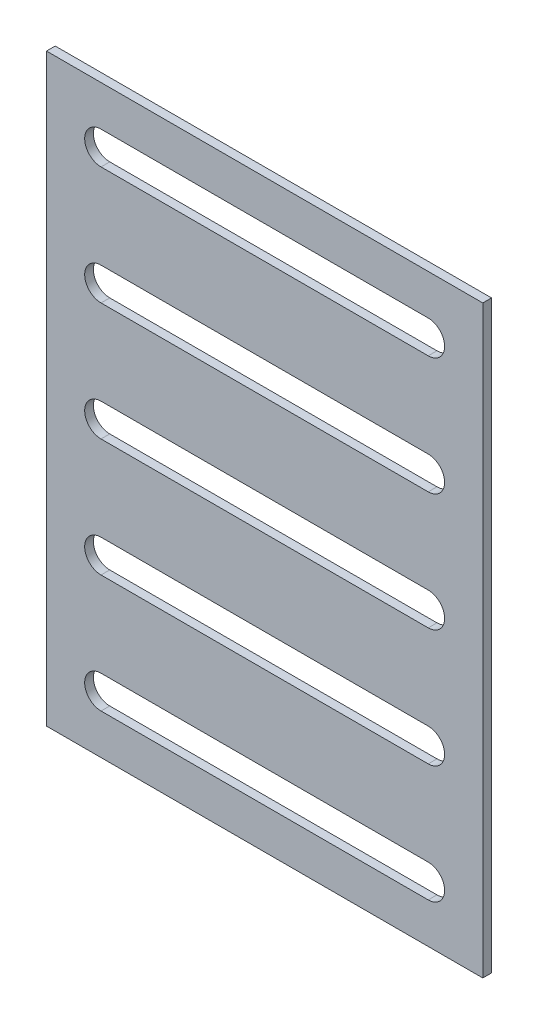
ISO-10303-21;
HEADER;
FILE_DESCRIPTION(('STEP AP214'),'2;1');
FILE_NAME('part.step','',(''),(''),'','','');
FILE_SCHEMA(('AUTOMOTIVE_DESIGN { 1 0 10303 214 1 1 1 1 }'));
ENDSEC;
DATA;
#1=APPLICATION_CONTEXT('core data for automotive mechanical design processes');
#2=APPLICATION_PROTOCOL_DEFINITION('international standard','automotive_design',2000,#1);
#3=PRODUCT_CONTEXT('',#1,'mechanical');
#4=PRODUCT('Part','Part','',(#3));
#5=PRODUCT_RELATED_PRODUCT_CATEGORY('part','',(#4));
#6=PRODUCT_DEFINITION_FORMATION('','',#4);
#7=PRODUCT_DEFINITION_CONTEXT('part definition',#1,'design');
#8=PRODUCT_DEFINITION('design','',#6,#7);
#9=PRODUCT_DEFINITION_SHAPE('','',#8);
#10=(LENGTH_UNIT() NAMED_UNIT(*) SI_UNIT(.MILLI.,.METRE.));
#11=(NAMED_UNIT(*) PLANE_ANGLE_UNIT() SI_UNIT($,.RADIAN.));
#12=(NAMED_UNIT(*) SI_UNIT($,.STERADIAN.) SOLID_ANGLE_UNIT());
#13=UNCERTAINTY_MEASURE_WITH_UNIT(LENGTH_MEASURE(1.E-05),#10,'distance_accuracy_value','');
#14=(GEOMETRIC_REPRESENTATION_CONTEXT(3) GLOBAL_UNCERTAINTY_ASSIGNED_CONTEXT((#13)) GLOBAL_UNIT_ASSIGNED_CONTEXT((#10,
#11,#12)) REPRESENTATION_CONTEXT('',''));
#15=CARTESIAN_POINT('',(0.,0.,0.));
#16=DIRECTION('',(0.,0.,1.));
#17=DIRECTION('',(1.,0.,0.));
#18=AXIS2_PLACEMENT_3D('',#15,#16,#17);
#19=CARTESIAN_POINT('',(-100.,134.,4.));
#20=DIRECTION('',(1.,0.,0.));
#21=DIRECTION('',(0.,1.,0.));
#22=AXIS2_PLACEMENT_3D('',#19,#20,#21);
#23=PLANE('',#22);
#24=DIRECTION('',(0.,-1.,0.));
#25=VECTOR('',#24,1.);
#26=CARTESIAN_POINT('',(-100.,134.,0.));
#27=LINE('',#26,#25);
#28=CARTESIAN_POINT('',(-100.,134.,0.));
#29=VERTEX_POINT('',#28);
#30=CARTESIAN_POINT('',(-100.,-134.,0.));
#31=VERTEX_POINT('',#30);
#32=EDGE_CURVE('E233',#29,#31,#27,.T.);
#33=ORIENTED_EDGE('',*,*,#32,.T.);
#34=DIRECTION('',(0.,0.,-1.));
#35=VECTOR('',#34,1.);
#36=CARTESIAN_POINT('',(-100.,-134.,4.));
#37=LINE('',#36,#35);
#38=CARTESIAN_POINT('',(-100.,-134.,4.));
#39=VERTEX_POINT('',#38);
#40=EDGE_CURVE('E11',#39,#31,#37,.T.);
#41=ORIENTED_EDGE('',*,*,#40,.F.);
#42=DIRECTION('',(0.,-1.,0.));
#43=VECTOR('',#42,1.);
#44=CARTESIAN_POINT('',(-100.,134.,4.));
#45=LINE('',#44,#43);
#46=CARTESIAN_POINT('',(-100.,134.,4.));
#47=VERTEX_POINT('',#46);
#48=EDGE_CURVE('E362',#47,#39,#45,.T.);
#49=ORIENTED_EDGE('',*,*,#48,.F.);
#50=DIRECTION('',(0.,0.,-1.));
#51=VECTOR('',#50,1.);
#52=CARTESIAN_POINT('',(-100.,134.,4.));
#53=LINE('',#52,#51);
#54=EDGE_CURVE('E372',#47,#29,#53,.T.);
#55=ORIENTED_EDGE('',*,*,#54,.T.);
#56=EDGE_LOOP('',(#33,#41,#49,#55));
#57=FACE_BOUND('',#56,.T.);
#58=ADVANCED_FACE('F36',(#57),#23,.F.);
#59=CARTESIAN_POINT('',(-100.,-134.,4.));
#60=DIRECTION('',(0.,1.,0.));
#61=DIRECTION('',(0.,0.,1.));
#62=AXIS2_PLACEMENT_3D('',#59,#60,#61);
#63=PLANE('',#62);
#64=DIRECTION('',(1.,0.,0.));
#65=VECTOR('',#64,1.);
#66=CARTESIAN_POINT('',(-100.,-134.,0.));
#67=LINE('',#66,#65);
#68=CARTESIAN_POINT('',(100.,-134.,0.));
#69=VERTEX_POINT('',#68);
#70=EDGE_CURVE('E375',#31,#69,#67,.T.);
#71=ORIENTED_EDGE('',*,*,#70,.T.);
#72=DIRECTION('',(0.,0.,-1.));
#73=VECTOR('',#72,1.);
#74=CARTESIAN_POINT('',(100.,-134.,4.));
#75=LINE('',#74,#73);
#76=CARTESIAN_POINT('',(100.,-134.,4.));
#77=VERTEX_POINT('',#76);
#78=EDGE_CURVE('E43',#77,#69,#75,.T.);
#79=ORIENTED_EDGE('',*,*,#78,.F.);
#80=DIRECTION('',(1.,0.,0.));
#81=VECTOR('',#80,1.);
#82=CARTESIAN_POINT('',(-100.,-134.,4.));
#83=LINE('',#82,#81);
#84=EDGE_CURVE('E365',#39,#77,#83,.T.);
#85=ORIENTED_EDGE('',*,*,#84,.F.);
#86=ORIENTED_EDGE('',*,*,#40,.T.);
#87=EDGE_LOOP('',(#71,#79,#85,#86));
#88=FACE_BOUND('',#87,.T.);
#89=ADVANCED_FACE('F404',(#88),#63,.F.);
#90=CARTESIAN_POINT('',(100.,134.,4.));
#91=DIRECTION('',(-1.,0.,0.));
#92=DIRECTION('',(0.,-1.,0.));
#93=AXIS2_PLACEMENT_3D('',#90,#91,#92);
#94=PLANE('',#93);
#95=DIRECTION('',(0.,1.,0.));
#96=VECTOR('',#95,1.);
#97=CARTESIAN_POINT('',(100.,134.,0.));
#98=LINE('',#97,#96);
#99=CARTESIAN_POINT('',(100.,134.,0.));
#100=VERTEX_POINT('',#99);
#101=EDGE_CURVE('E377',#69,#100,#98,.T.);
#102=ORIENTED_EDGE('',*,*,#101,.T.);
#103=DIRECTION('',(0.,0.,-1.));
#104=VECTOR('',#103,1.);
#105=CARTESIAN_POINT('',(100.,134.,4.));
#106=LINE('',#105,#104);
#107=CARTESIAN_POINT('',(100.,134.,4.));
#108=VERTEX_POINT('',#107);
#109=EDGE_CURVE('E382',#108,#100,#106,.T.);
#110=ORIENTED_EDGE('',*,*,#109,.F.);
#111=DIRECTION('',(0.,1.,0.));
#112=VECTOR('',#111,1.);
#113=CARTESIAN_POINT('',(100.,134.,4.));
#114=LINE('',#113,#112);
#115=EDGE_CURVE('E368',#77,#108,#114,.T.);
#116=ORIENTED_EDGE('',*,*,#115,.F.);
#117=ORIENTED_EDGE('',*,*,#78,.T.);
#118=EDGE_LOOP('',(#102,#110,#116,#117));
#119=FACE_BOUND('',#118,.T.);
#120=ADVANCED_FACE('F389',(#119),#94,.F.);
#121=CARTESIAN_POINT('',(-100.,134.,4.));
#122=DIRECTION('',(0.,-1.,0.));
#123=DIRECTION('',(0.,0.,-1.));
#124=AXIS2_PLACEMENT_3D('',#121,#122,#123);
#125=PLANE('',#124);
#126=DIRECTION('',(-1.,0.,0.));
#127=VECTOR('',#126,1.);
#128=CARTESIAN_POINT('',(-100.,134.,0.));
#129=LINE('',#128,#127);
#130=EDGE_CURVE('E366',#100,#29,#129,.T.);
#131=ORIENTED_EDGE('',*,*,#130,.T.);
#132=ORIENTED_EDGE('',*,*,#54,.F.);
#133=DIRECTION('',(-1.,0.,0.));
#134=VECTOR('',#133,1.);
#135=CARTESIAN_POINT('',(-100.,134.,4.));
#136=LINE('',#135,#134);
#137=EDGE_CURVE('E370',#108,#47,#136,.T.);
#138=ORIENTED_EDGE('',*,*,#137,.F.);
#139=ORIENTED_EDGE('',*,*,#109,.T.);
#140=EDGE_LOOP('',(#131,#132,#138,#139));
#141=FACE_BOUND('',#140,.T.);
#142=ADVANCED_FACE('F397',(#141),#125,.F.);
#143=CARTESIAN_POINT('',(0.,0.,4.));
#144=DIRECTION('',(0.,0.,1.));
#145=DIRECTION('',(1.,0.,0.));
#146=AXIS2_PLACEMENT_3D('',#143,#144,#145);
#147=PLANE('',#146);
#148=CARTESIAN_POINT('',(-75.,108.,4.));
#149=DIRECTION('',(0.,0.,1.));
#150=DIRECTION('',(1.,0.,0.));
#151=AXIS2_PLACEMENT_3D('',#148,#149,#150);
#152=CIRCLE('',#151,7.50000000000002);
#153=CARTESIAN_POINT('',(-75.,115.5,4.));
#154=VERTEX_POINT('',#153);
#155=CARTESIAN_POINT('',(-75.,100.5,4.));
#156=VERTEX_POINT('',#155);
#157=EDGE_CURVE('E50',#154,#156,#152,.T.);
#158=ORIENTED_EDGE('',*,*,#157,.F.);
#159=DIRECTION('',(-1.,0.,0.));
#160=VECTOR('',#159,1.);
#161=CARTESIAN_POINT('',(-75.,115.5,4.));
#162=LINE('',#161,#160);
#163=CARTESIAN_POINT('',(75.,115.5,4.));
#164=VERTEX_POINT('',#163);
#165=EDGE_CURVE('E217',#164,#154,#162,.T.);
#166=ORIENTED_EDGE('',*,*,#165,.F.);
#167=CARTESIAN_POINT('',(75.,108.,4.));
#168=DIRECTION('',(0.,0.,1.));
#169=DIRECTION('',(1.,0.,0.));
#170=AXIS2_PLACEMENT_3D('',#167,#168,#169);
#171=CIRCLE('',#170,7.50000000000002);
#172=CARTESIAN_POINT('',(75.,100.5,4.));
#173=VERTEX_POINT('',#172);
#174=EDGE_CURVE('E220',#173,#164,#171,.T.);
#175=ORIENTED_EDGE('',*,*,#174,.F.);
#176=DIRECTION('',(1.,0.,0.));
#177=VECTOR('',#176,1.);
#178=CARTESIAN_POINT('',(-75.,100.5,4.));
#179=LINE('',#178,#177);
#180=EDGE_CURVE('E226',#156,#173,#179,.T.);
#181=ORIENTED_EDGE('',*,*,#180,.F.);
#182=EDGE_LOOP('',(#158,#166,#175,#181));
#183=FACE_BOUND('',#182,.T.);
#184=CARTESIAN_POINT('',(-75.,54.,4.));
#185=DIRECTION('',(0.,0.,1.));
#186=DIRECTION('',(1.,0.,0.));
#187=AXIS2_PLACEMENT_3D('',#184,#185,#186);
#188=CIRCLE('',#187,7.50000000000002);
#189=CARTESIAN_POINT('',(-75.,61.5,4.));
#190=VERTEX_POINT('',#189);
#191=CARTESIAN_POINT('',(-75.,46.5,4.));
#192=VERTEX_POINT('',#191);
#193=EDGE_CURVE('E58',#190,#192,#188,.T.);
#194=ORIENTED_EDGE('',*,*,#193,.F.);
#195=DIRECTION('',(-1.,0.,0.));
#196=VECTOR('',#195,1.);
#197=CARTESIAN_POINT('',(-75.,61.5,4.));
#198=LINE('',#197,#196);
#199=CARTESIAN_POINT('',(75.,61.5,4.));
#200=VERTEX_POINT('',#199);
#201=EDGE_CURVE('E241',#200,#190,#198,.T.);
#202=ORIENTED_EDGE('',*,*,#201,.F.);
#203=CARTESIAN_POINT('',(75.,54.,4.));
#204=DIRECTION('',(0.,0.,1.));
#205=DIRECTION('',(1.,0.,0.));
#206=AXIS2_PLACEMENT_3D('',#203,#204,#205);
#207=CIRCLE('',#206,7.5);
#208=CARTESIAN_POINT('',(75.0000000000001,46.5,4.));
#209=VERTEX_POINT('',#208);
#210=EDGE_CURVE('E256',#209,#200,#207,.T.);
#211=ORIENTED_EDGE('',*,*,#210,.F.);
#212=DIRECTION('',(1.,0.,0.));
#213=VECTOR('',#212,1.);
#214=CARTESIAN_POINT('',(75.0000000000001,46.5,4.));
#215=LINE('',#214,#213);
#216=EDGE_CURVE('E252',#192,#209,#215,.T.);
#217=ORIENTED_EDGE('',*,*,#216,.F.);
#218=EDGE_LOOP('',(#194,#202,#211,#217));
#219=FACE_BOUND('',#218,.T.);
#220=CARTESIAN_POINT('',(-75.,0.,4.));
#221=DIRECTION('',(0.,0.,1.));
#222=DIRECTION('',(1.,0.,0.));
#223=AXIS2_PLACEMENT_3D('',#220,#221,#222);
#224=CIRCLE('',#223,7.50000000000001);
#225=CARTESIAN_POINT('',(-75.,7.50000000000001,4.));
#226=VERTEX_POINT('',#225);
#227=CARTESIAN_POINT('',(-75.,-7.50000000000001,4.));
#228=VERTEX_POINT('',#227);
#229=EDGE_CURVE('E281',#226,#228,#224,.T.);
#230=ORIENTED_EDGE('',*,*,#229,.F.);
#231=DIRECTION('',(-1.,0.,0.));
#232=VECTOR('',#231,1.);
#233=CARTESIAN_POINT('',(-75.,7.50000000000001,4.));
#234=LINE('',#233,#232);
#235=CARTESIAN_POINT('',(75.,7.50000000000001,4.));
#236=VERTEX_POINT('',#235);
#237=EDGE_CURVE('E271',#236,#226,#234,.T.);
#238=ORIENTED_EDGE('',*,*,#237,.F.);
#239=CARTESIAN_POINT('',(75.,0.,4.));
#240=DIRECTION('',(0.,0.,1.));
#241=DIRECTION('',(1.,0.,0.));
#242=AXIS2_PLACEMENT_3D('',#239,#240,#241);
#243=CIRCLE('',#242,7.50000000000001);
#244=CARTESIAN_POINT('',(75.,-7.50000000000001,4.));
#245=VERTEX_POINT('',#244);
#246=EDGE_CURVE('E287',#245,#236,#243,.T.);
#247=ORIENTED_EDGE('',*,*,#246,.F.);
#248=DIRECTION('',(1.,0.,0.));
#249=VECTOR('',#248,1.);
#250=CARTESIAN_POINT('',(-75.,-7.50000000000001,4.));
#251=LINE('',#250,#249);
#252=EDGE_CURVE('E283',#228,#245,#251,.T.);
#253=ORIENTED_EDGE('',*,*,#252,.F.);
#254=EDGE_LOOP('',(#230,#238,#247,#253));
#255=FACE_BOUND('',#254,.T.);
#256=CARTESIAN_POINT('',(-75.,-54.,4.));
#257=DIRECTION('',(0.,0.,1.));
#258=DIRECTION('',(1.,0.,0.));
#259=AXIS2_PLACEMENT_3D('',#256,#257,#258);
#260=CIRCLE('',#259,7.50000000000001);
#261=CARTESIAN_POINT('',(-75.,-46.5,4.));
#262=VERTEX_POINT('',#261);
#263=CARTESIAN_POINT('',(-75.,-61.5,4.));
#264=VERTEX_POINT('',#263);
#265=EDGE_CURVE('E313',#262,#264,#260,.T.);
#266=ORIENTED_EDGE('',*,*,#265,.F.);
#267=DIRECTION('',(-1.,0.,0.));
#268=VECTOR('',#267,1.);
#269=CARTESIAN_POINT('',(-75.,-46.5,4.));
#270=LINE('',#269,#268);
#271=CARTESIAN_POINT('',(75.,-46.5,4.));
#272=VERTEX_POINT('',#271);
#273=EDGE_CURVE('E303',#272,#262,#270,.T.);
#274=ORIENTED_EDGE('',*,*,#273,.F.);
#275=CARTESIAN_POINT('',(75.,-54.,4.));
#276=DIRECTION('',(0.,0.,1.));
#277=DIRECTION('',(1.,0.,0.));
#278=AXIS2_PLACEMENT_3D('',#275,#276,#277);
#279=CIRCLE('',#278,7.50000000000001);
#280=CARTESIAN_POINT('',(75.,-61.5,4.));
#281=VERTEX_POINT('',#280);
#282=EDGE_CURVE('E319',#281,#272,#279,.T.);
#283=ORIENTED_EDGE('',*,*,#282,.F.);
#284=DIRECTION('',(1.,0.,0.));
#285=VECTOR('',#284,1.);
#286=CARTESIAN_POINT('',(-75.,-61.5,4.));
#287=LINE('',#286,#285);
#288=EDGE_CURVE('E315',#264,#281,#287,.T.);
#289=ORIENTED_EDGE('',*,*,#288,.F.);
#290=EDGE_LOOP('',(#266,#274,#283,#289));
#291=FACE_BOUND('',#290,.T.);
#292=CARTESIAN_POINT('',(-75.,-108.,4.));
#293=DIRECTION('',(0.,0.,1.));
#294=DIRECTION('',(1.,0.,0.));
#295=AXIS2_PLACEMENT_3D('',#292,#293,#294);
#296=CIRCLE('',#295,7.50000000000002);
#297=CARTESIAN_POINT('',(-75.,-100.5,4.));
#298=VERTEX_POINT('',#297);
#299=CARTESIAN_POINT('',(-75.,-115.5,4.));
#300=VERTEX_POINT('',#299);
#301=EDGE_CURVE('E345',#298,#300,#296,.T.);
#302=ORIENTED_EDGE('',*,*,#301,.F.);
#303=DIRECTION('',(-1.,0.,0.));
#304=VECTOR('',#303,1.);
#305=CARTESIAN_POINT('',(-75.,-100.5,4.));
#306=LINE('',#305,#304);
#307=CARTESIAN_POINT('',(75.,-100.5,4.));
#308=VERTEX_POINT('',#307);
#309=EDGE_CURVE('E335',#308,#298,#306,.T.);
#310=ORIENTED_EDGE('',*,*,#309,.F.);
#311=CARTESIAN_POINT('',(75.,-108.,4.));
#312=DIRECTION('',(0.,0.,1.));
#313=DIRECTION('',(1.,0.,0.));
#314=AXIS2_PLACEMENT_3D('',#311,#312,#313);
#315=CIRCLE('',#314,7.50000000000002);
#316=CARTESIAN_POINT('',(75.,-115.5,4.));
#317=VERTEX_POINT('',#316);
#318=EDGE_CURVE('E350',#317,#308,#315,.T.);
#319=ORIENTED_EDGE('',*,*,#318,.F.);
#320=DIRECTION('',(1.,0.,0.));
#321=VECTOR('',#320,1.);
#322=CARTESIAN_POINT('',(-75.,-115.5,4.));
#323=LINE('',#322,#321);
#324=EDGE_CURVE('E347',#300,#317,#323,.T.);
#325=ORIENTED_EDGE('',*,*,#324,.F.);
#326=EDGE_LOOP('',(#302,#310,#319,#325));
#327=FACE_BOUND('',#326,.T.);
#328=ORIENTED_EDGE('',*,*,#48,.T.);
#329=ORIENTED_EDGE('',*,*,#84,.T.);
#330=ORIENTED_EDGE('',*,*,#115,.T.);
#331=ORIENTED_EDGE('',*,*,#137,.T.);
#332=EDGE_LOOP('',(#328,#329,#330,#331));
#333=FACE_BOUND('',#332,.T.);
#334=ADVANCED_FACE('F403',(#183,#219,#255,#291,#327,#333),#147,.T.);
#335=CARTESIAN_POINT('',(0.,0.,0.));
#336=DIRECTION('',(0.,0.,1.));
#337=DIRECTION('',(1.,0.,0.));
#338=AXIS2_PLACEMENT_3D('',#335,#336,#337);
#339=PLANE('',#338);
#340=DIRECTION('',(-1.,0.,0.));
#341=VECTOR('',#340,1.);
#342=CARTESIAN_POINT('',(-75.,115.5,0.));
#343=LINE('',#342,#341);
#344=CARTESIAN_POINT('',(75.,115.5,0.));
#345=VERTEX_POINT('',#344);
#346=CARTESIAN_POINT('',(-75.,115.5,0.));
#347=VERTEX_POINT('',#346);
#348=EDGE_CURVE('E204',#345,#347,#343,.T.);
#349=ORIENTED_EDGE('',*,*,#348,.T.);
#350=CARTESIAN_POINT('',(-75.,108.,0.));
#351=DIRECTION('',(0.,0.,1.));
#352=DIRECTION('',(1.,0.,0.));
#353=AXIS2_PLACEMENT_3D('',#350,#351,#352);
#354=CIRCLE('',#353,7.50000000000002);
#355=CARTESIAN_POINT('',(-75.,100.5,0.));
#356=VERTEX_POINT('',#355);
#357=EDGE_CURVE('E198',#347,#356,#354,.T.);
#358=ORIENTED_EDGE('',*,*,#357,.T.);
#359=DIRECTION('',(1.,0.,0.));
#360=VECTOR('',#359,1.);
#361=CARTESIAN_POINT('',(-75.,100.5,0.));
#362=LINE('',#361,#360);
#363=CARTESIAN_POINT('',(75.,100.5,0.));
#364=VERTEX_POINT('',#363);
#365=EDGE_CURVE('E208',#356,#364,#362,.T.);
#366=ORIENTED_EDGE('',*,*,#365,.T.);
#367=CARTESIAN_POINT('',(75.,108.,0.));
#368=DIRECTION('',(0.,0.,1.));
#369=DIRECTION('',(1.,0.,0.));
#370=AXIS2_PLACEMENT_3D('',#367,#368,#369);
#371=CIRCLE('',#370,7.50000000000002);
#372=EDGE_CURVE('E212',#364,#345,#371,.T.);
#373=ORIENTED_EDGE('',*,*,#372,.T.);
#374=EDGE_LOOP('',(#349,#358,#366,#373));
#375=FACE_BOUND('',#374,.T.);
#376=DIRECTION('',(-1.,0.,0.));
#377=VECTOR('',#376,1.);
#378=CARTESIAN_POINT('',(-75.,61.5,0.));
#379=LINE('',#378,#377);
#380=CARTESIAN_POINT('',(75.,61.5,0.));
#381=VERTEX_POINT('',#380);
#382=CARTESIAN_POINT('',(-75.,61.5,0.));
#383=VERTEX_POINT('',#382);
#384=EDGE_CURVE('E247',#381,#383,#379,.T.);
#385=ORIENTED_EDGE('',*,*,#384,.T.);
#386=CARTESIAN_POINT('',(-75.,54.,0.));
#387=DIRECTION('',(0.,0.,1.));
#388=DIRECTION('',(1.,0.,0.));
#389=AXIS2_PLACEMENT_3D('',#386,#387,#388);
#390=CIRCLE('',#389,7.50000000000002);
#391=CARTESIAN_POINT('',(-75.,46.5,0.));
#392=VERTEX_POINT('',#391);
#393=EDGE_CURVE('E237',#383,#392,#390,.T.);
#394=ORIENTED_EDGE('',*,*,#393,.T.);
#395=DIRECTION('',(1.,0.,0.));
#396=VECTOR('',#395,1.);
#397=CARTESIAN_POINT('',(75.0000000000001,46.5,0.));
#398=LINE('',#397,#396);
#399=CARTESIAN_POINT('',(75.0000000000001,46.5,0.));
#400=VERTEX_POINT('',#399);
#401=EDGE_CURVE('E240',#392,#400,#398,.T.);
#402=ORIENTED_EDGE('',*,*,#401,.T.);
#403=CARTESIAN_POINT('',(75.,54.,0.));
#404=DIRECTION('',(0.,0.,1.));
#405=DIRECTION('',(1.,0.,0.));
#406=AXIS2_PLACEMENT_3D('',#403,#404,#405);
#407=CIRCLE('',#406,7.5);
#408=EDGE_CURVE('E244',#400,#381,#407,.T.);
#409=ORIENTED_EDGE('',*,*,#408,.T.);
#410=EDGE_LOOP('',(#385,#394,#402,#409));
#411=FACE_BOUND('',#410,.T.);
#412=DIRECTION('',(-1.,0.,0.));
#413=VECTOR('',#412,1.);
#414=CARTESIAN_POINT('',(-75.,7.50000000000001,0.));
#415=LINE('',#414,#413);
#416=CARTESIAN_POINT('',(75.,7.50000000000001,0.));
#417=VERTEX_POINT('',#416);
#418=CARTESIAN_POINT('',(-75.,7.50000000000001,0.));
#419=VERTEX_POINT('',#418);
#420=EDGE_CURVE('E277',#417,#419,#415,.T.);
#421=ORIENTED_EDGE('',*,*,#420,.T.);
#422=CARTESIAN_POINT('',(-75.,0.,0.));
#423=DIRECTION('',(0.,0.,1.));
#424=DIRECTION('',(1.,0.,0.));
#425=AXIS2_PLACEMENT_3D('',#422,#423,#424);
#426=CIRCLE('',#425,7.50000000000001);
#427=CARTESIAN_POINT('',(-75.,-7.50000000000001,0.));
#428=VERTEX_POINT('',#427);
#429=EDGE_CURVE('E267',#419,#428,#426,.T.);
#430=ORIENTED_EDGE('',*,*,#429,.T.);
#431=DIRECTION('',(1.,0.,0.));
#432=VECTOR('',#431,1.);
#433=CARTESIAN_POINT('',(-75.,-7.50000000000001,0.));
#434=LINE('',#433,#432);
#435=CARTESIAN_POINT('',(75.,-7.50000000000001,0.));
#436=VERTEX_POINT('',#435);
#437=EDGE_CURVE('E270',#428,#436,#434,.T.);
#438=ORIENTED_EDGE('',*,*,#437,.T.);
#439=CARTESIAN_POINT('',(75.,0.,0.));
#440=DIRECTION('',(0.,0.,1.));
#441=DIRECTION('',(1.,0.,0.));
#442=AXIS2_PLACEMENT_3D('',#439,#440,#441);
#443=CIRCLE('',#442,7.50000000000001);
#444=EDGE_CURVE('E274',#436,#417,#443,.T.);
#445=ORIENTED_EDGE('',*,*,#444,.T.);
#446=EDGE_LOOP('',(#421,#430,#438,#445));
#447=FACE_BOUND('',#446,.T.);
#448=DIRECTION('',(-1.,0.,0.));
#449=VECTOR('',#448,1.);
#450=CARTESIAN_POINT('',(-75.,-46.5,0.));
#451=LINE('',#450,#449);
#452=CARTESIAN_POINT('',(75.,-46.5,0.));
#453=VERTEX_POINT('',#452);
#454=CARTESIAN_POINT('',(-75.,-46.5,0.));
#455=VERTEX_POINT('',#454);
#456=EDGE_CURVE('E309',#453,#455,#451,.T.);
#457=ORIENTED_EDGE('',*,*,#456,.T.);
#458=CARTESIAN_POINT('',(-75.,-54.,0.));
#459=DIRECTION('',(0.,0.,1.));
#460=DIRECTION('',(1.,0.,0.));
#461=AXIS2_PLACEMENT_3D('',#458,#459,#460);
#462=CIRCLE('',#461,7.50000000000001);
#463=CARTESIAN_POINT('',(-75.,-61.5,0.));
#464=VERTEX_POINT('',#463);
#465=EDGE_CURVE('E299',#455,#464,#462,.T.);
#466=ORIENTED_EDGE('',*,*,#465,.T.);
#467=DIRECTION('',(1.,0.,0.));
#468=VECTOR('',#467,1.);
#469=CARTESIAN_POINT('',(-75.,-61.5,0.));
#470=LINE('',#469,#468);
#471=CARTESIAN_POINT('',(75.,-61.5,0.));
#472=VERTEX_POINT('',#471);
#473=EDGE_CURVE('E302',#464,#472,#470,.T.);
#474=ORIENTED_EDGE('',*,*,#473,.T.);
#475=CARTESIAN_POINT('',(75.,-54.,0.));
#476=DIRECTION('',(0.,0.,1.));
#477=DIRECTION('',(1.,0.,0.));
#478=AXIS2_PLACEMENT_3D('',#475,#476,#477);
#479=CIRCLE('',#478,7.50000000000001);
#480=EDGE_CURVE('E306',#472,#453,#479,.T.);
#481=ORIENTED_EDGE('',*,*,#480,.T.);
#482=EDGE_LOOP('',(#457,#466,#474,#481));
#483=FACE_BOUND('',#482,.T.);
#484=DIRECTION('',(-1.,0.,0.));
#485=VECTOR('',#484,1.);
#486=CARTESIAN_POINT('',(-75.,-100.5,0.));
#487=LINE('',#486,#485);
#488=CARTESIAN_POINT('',(75.,-100.5,0.));
#489=VERTEX_POINT('',#488);
#490=CARTESIAN_POINT('',(-75.,-100.5,0.));
#491=VERTEX_POINT('',#490);
#492=EDGE_CURVE('E341',#489,#491,#487,.T.);
#493=ORIENTED_EDGE('',*,*,#492,.T.);
#494=CARTESIAN_POINT('',(-75.,-108.,0.));
#495=DIRECTION('',(0.,0.,1.));
#496=DIRECTION('',(1.,0.,0.));
#497=AXIS2_PLACEMENT_3D('',#494,#495,#496);
#498=CIRCLE('',#497,7.50000000000002);
#499=CARTESIAN_POINT('',(-75.,-115.5,0.));
#500=VERTEX_POINT('',#499);
#501=EDGE_CURVE('E331',#491,#500,#498,.T.);
#502=ORIENTED_EDGE('',*,*,#501,.T.);
#503=DIRECTION('',(1.,0.,0.));
#504=VECTOR('',#503,1.);
#505=CARTESIAN_POINT('',(-75.,-115.5,0.));
#506=LINE('',#505,#504);
#507=CARTESIAN_POINT('',(75.,-115.5,0.));
#508=VERTEX_POINT('',#507);
#509=EDGE_CURVE('E334',#500,#508,#506,.T.);
#510=ORIENTED_EDGE('',*,*,#509,.T.);
#511=CARTESIAN_POINT('',(75.,-108.,0.));
#512=DIRECTION('',(0.,0.,1.));
#513=DIRECTION('',(1.,0.,0.));
#514=AXIS2_PLACEMENT_3D('',#511,#512,#513);
#515=CIRCLE('',#514,7.50000000000002);
#516=EDGE_CURVE('E338',#508,#489,#515,.T.);
#517=ORIENTED_EDGE('',*,*,#516,.T.);
#518=EDGE_LOOP('',(#493,#502,#510,#517));
#519=FACE_BOUND('',#518,.T.);
#520=ORIENTED_EDGE('',*,*,#32,.F.);
#521=ORIENTED_EDGE('',*,*,#130,.F.);
#522=ORIENTED_EDGE('',*,*,#101,.F.);
#523=ORIENTED_EDGE('',*,*,#70,.F.);
#524=EDGE_LOOP('',(#520,#521,#522,#523));
#525=FACE_BOUND('',#524,.T.);
#526=ADVANCED_FACE('F214',(#375,#411,#447,#483,#519,#525),#339,.F.);
#527=CARTESIAN_POINT('',(-75.,-108.,0.));
#528=DIRECTION('',(0.,0.,1.));
#529=DIRECTION('',(1.,0.,0.));
#530=AXIS2_PLACEMENT_3D('',#527,#528,#529);
#531=CYLINDRICAL_SURFACE('',#530,7.50000000000002);
#532=ORIENTED_EDGE('',*,*,#301,.T.);
#533=DIRECTION('',(0.,0.,1.));
#534=VECTOR('',#533,1.);
#535=CARTESIAN_POINT('',(-75.,-115.5,0.));
#536=LINE('',#535,#534);
#537=EDGE_CURVE('E344',#500,#300,#536,.T.);
#538=ORIENTED_EDGE('',*,*,#537,.F.);
#539=ORIENTED_EDGE('',*,*,#501,.F.);
#540=DIRECTION('',(0.,0.,1.));
#541=VECTOR('',#540,1.);
#542=CARTESIAN_POINT('',(-75.,-100.5,0.));
#543=LINE('',#542,#541);
#544=EDGE_CURVE('E316',#491,#298,#543,.T.);
#545=ORIENTED_EDGE('',*,*,#544,.T.);
#546=EDGE_LOOP('',(#532,#538,#539,#545));
#547=FACE_BOUND('',#546,.T.);
#548=ADVANCED_FACE('F416',(#547),#531,.F.);
#549=CARTESIAN_POINT('',(-75.,-100.5,0.));
#550=DIRECTION('',(0.,1.,0.));
#551=DIRECTION('',(0.,0.,1.));
#552=AXIS2_PLACEMENT_3D('',#549,#550,#551);
#553=PLANE('',#552);
#554=ORIENTED_EDGE('',*,*,#309,.T.);
#555=ORIENTED_EDGE('',*,*,#544,.F.);
#556=ORIENTED_EDGE('',*,*,#492,.F.);
#557=DIRECTION('',(0.,0.,1.));
#558=VECTOR('',#557,1.);
#559=CARTESIAN_POINT('',(75.,-100.5,0.));
#560=LINE('',#559,#558);
#561=EDGE_CURVE('E356',#489,#308,#560,.T.);
#562=ORIENTED_EDGE('',*,*,#561,.T.);
#563=EDGE_LOOP('',(#554,#555,#556,#562));
#564=FACE_BOUND('',#563,.T.);
#565=ADVANCED_FACE('F422',(#564),#553,.F.);
#566=CARTESIAN_POINT('',(75.,-108.,0.));
#567=DIRECTION('',(0.,0.,1.));
#568=DIRECTION('',(1.,0.,0.));
#569=AXIS2_PLACEMENT_3D('',#566,#567,#568);
#570=CYLINDRICAL_SURFACE('',#569,7.50000000000002);
#571=ORIENTED_EDGE('',*,*,#318,.T.);
#572=ORIENTED_EDGE('',*,*,#561,.F.);
#573=ORIENTED_EDGE('',*,*,#516,.F.);
#574=DIRECTION('',(0.,0.,1.));
#575=VECTOR('',#574,1.);
#576=CARTESIAN_POINT('',(75.,-115.5,0.));
#577=LINE('',#576,#575);
#578=EDGE_CURVE('E358',#508,#317,#577,.T.);
#579=ORIENTED_EDGE('',*,*,#578,.T.);
#580=EDGE_LOOP('',(#571,#572,#573,#579));
#581=FACE_BOUND('',#580,.T.);
#582=ADVANCED_FACE('F428',(#581),#570,.F.);
#583=CARTESIAN_POINT('',(-75.,-115.5,0.));
#584=DIRECTION('',(0.,-1.,0.));
#585=DIRECTION('',(0.,0.,-1.));
#586=AXIS2_PLACEMENT_3D('',#583,#584,#585);
#587=PLANE('',#586);
#588=ORIENTED_EDGE('',*,*,#324,.T.);
#589=ORIENTED_EDGE('',*,*,#578,.F.);
#590=ORIENTED_EDGE('',*,*,#509,.F.);
#591=ORIENTED_EDGE('',*,*,#537,.T.);
#592=EDGE_LOOP('',(#588,#589,#590,#591));
#593=FACE_BOUND('',#592,.T.);
#594=ADVANCED_FACE('F424',(#593),#587,.F.);
#595=CARTESIAN_POINT('',(-75.,-54.,0.));
#596=DIRECTION('',(0.,0.,1.));
#597=DIRECTION('',(1.,0.,0.));
#598=AXIS2_PLACEMENT_3D('',#595,#596,#597);
#599=CYLINDRICAL_SURFACE('',#598,7.50000000000001);
#600=ORIENTED_EDGE('',*,*,#265,.T.);
#601=DIRECTION('',(0.,0.,1.));
#602=VECTOR('',#601,1.);
#603=CARTESIAN_POINT('',(-75.,-61.5,0.));
#604=LINE('',#603,#602);
#605=EDGE_CURVE('E312',#464,#264,#604,.T.);
#606=ORIENTED_EDGE('',*,*,#605,.F.);
#607=ORIENTED_EDGE('',*,*,#465,.F.);
#608=DIRECTION('',(0.,0.,1.));
#609=VECTOR('',#608,1.);
#610=CARTESIAN_POINT('',(-75.,-46.5,0.));
#611=LINE('',#610,#609);
#612=EDGE_CURVE('E284',#455,#262,#611,.T.);
#613=ORIENTED_EDGE('',*,*,#612,.T.);
#614=EDGE_LOOP('',(#600,#606,#607,#613));
#615=FACE_BOUND('',#614,.T.);
#616=ADVANCED_FACE('F427',(#615),#599,.F.);
#617=CARTESIAN_POINT('',(-75.,-46.5,0.));
#618=DIRECTION('',(0.,1.,0.));
#619=DIRECTION('',(0.,0.,1.));
#620=AXIS2_PLACEMENT_3D('',#617,#618,#619);
#621=PLANE('',#620);
#622=ORIENTED_EDGE('',*,*,#273,.T.);
#623=ORIENTED_EDGE('',*,*,#612,.F.);
#624=ORIENTED_EDGE('',*,*,#456,.F.);
#625=DIRECTION('',(0.,0.,1.));
#626=VECTOR('',#625,1.);
#627=CARTESIAN_POINT('',(75.,-46.5,0.));
#628=LINE('',#627,#626);
#629=EDGE_CURVE('E325',#453,#272,#628,.T.);
#630=ORIENTED_EDGE('',*,*,#629,.T.);
#631=EDGE_LOOP('',(#622,#623,#624,#630));
#632=FACE_BOUND('',#631,.T.);
#633=ADVANCED_FACE('F438',(#632),#621,.F.);
#634=CARTESIAN_POINT('',(75.,-54.,0.));
#635=DIRECTION('',(0.,0.,1.));
#636=DIRECTION('',(1.,0.,0.));
#637=AXIS2_PLACEMENT_3D('',#634,#635,#636);
#638=CYLINDRICAL_SURFACE('',#637,7.50000000000001);
#639=ORIENTED_EDGE('',*,*,#282,.T.);
#640=ORIENTED_EDGE('',*,*,#629,.F.);
#641=ORIENTED_EDGE('',*,*,#480,.F.);
#642=DIRECTION('',(0.,0.,1.));
#643=VECTOR('',#642,1.);
#644=CARTESIAN_POINT('',(75.,-61.5,0.));
#645=LINE('',#644,#643);
#646=EDGE_CURVE('E327',#472,#281,#645,.T.);
#647=ORIENTED_EDGE('',*,*,#646,.T.);
#648=EDGE_LOOP('',(#639,#640,#641,#647));
#649=FACE_BOUND('',#648,.T.);
#650=ADVANCED_FACE('F444',(#649),#638,.F.);
#651=CARTESIAN_POINT('',(-75.,-61.5,0.));
#652=DIRECTION('',(0.,-1.,0.));
#653=DIRECTION('',(0.,0.,-1.));
#654=AXIS2_PLACEMENT_3D('',#651,#652,#653);
#655=PLANE('',#654);
#656=ORIENTED_EDGE('',*,*,#288,.T.);
#657=ORIENTED_EDGE('',*,*,#646,.F.);
#658=ORIENTED_EDGE('',*,*,#473,.F.);
#659=ORIENTED_EDGE('',*,*,#605,.T.);
#660=EDGE_LOOP('',(#656,#657,#658,#659));
#661=FACE_BOUND('',#660,.T.);
#662=ADVANCED_FACE('F440',(#661),#655,.F.);
#663=CARTESIAN_POINT('',(-75.,0.,0.));
#664=DIRECTION('',(0.,0.,1.));
#665=DIRECTION('',(1.,0.,0.));
#666=AXIS2_PLACEMENT_3D('',#663,#664,#665);
#667=CYLINDRICAL_SURFACE('',#666,7.50000000000001);
#668=ORIENTED_EDGE('',*,*,#229,.T.);
#669=DIRECTION('',(0.,0.,1.));
#670=VECTOR('',#669,1.);
#671=CARTESIAN_POINT('',(-75.,-7.50000000000001,0.));
#672=LINE('',#671,#670);
#673=EDGE_CURVE('E280',#428,#228,#672,.T.);
#674=ORIENTED_EDGE('',*,*,#673,.F.);
#675=ORIENTED_EDGE('',*,*,#429,.F.);
#676=DIRECTION('',(0.,0.,1.));
#677=VECTOR('',#676,1.);
#678=CARTESIAN_POINT('',(-75.,7.50000000000001,0.));
#679=LINE('',#678,#677);
#680=EDGE_CURVE('E253',#419,#226,#679,.T.);
#681=ORIENTED_EDGE('',*,*,#680,.T.);
#682=EDGE_LOOP('',(#668,#674,#675,#681));
#683=FACE_BOUND('',#682,.T.);
#684=ADVANCED_FACE('F443',(#683),#667,.F.);
#685=CARTESIAN_POINT('',(-75.,7.50000000000001,0.));
#686=DIRECTION('',(0.,1.,0.));
#687=DIRECTION('',(0.,0.,1.));
#688=AXIS2_PLACEMENT_3D('',#685,#686,#687);
#689=PLANE('',#688);
#690=ORIENTED_EDGE('',*,*,#237,.T.);
#691=ORIENTED_EDGE('',*,*,#680,.F.);
#692=ORIENTED_EDGE('',*,*,#420,.F.);
#693=DIRECTION('',(0.,0.,1.));
#694=VECTOR('',#693,1.);
#695=CARTESIAN_POINT('',(75.,7.50000000000001,0.));
#696=LINE('',#695,#694);
#697=EDGE_CURVE('E293',#417,#236,#696,.T.);
#698=ORIENTED_EDGE('',*,*,#697,.T.);
#699=EDGE_LOOP('',(#690,#691,#692,#698));
#700=FACE_BOUND('',#699,.T.);
#701=ADVANCED_FACE('F454',(#700),#689,.F.);
#702=CARTESIAN_POINT('',(75.,0.,0.));
#703=DIRECTION('',(0.,0.,1.));
#704=DIRECTION('',(1.,0.,0.));
#705=AXIS2_PLACEMENT_3D('',#702,#703,#704);
#706=CYLINDRICAL_SURFACE('',#705,7.50000000000001);
#707=ORIENTED_EDGE('',*,*,#246,.T.);
#708=ORIENTED_EDGE('',*,*,#697,.F.);
#709=ORIENTED_EDGE('',*,*,#444,.F.);
#710=DIRECTION('',(0.,0.,1.));
#711=VECTOR('',#710,1.);
#712=CARTESIAN_POINT('',(75.,-7.50000000000001,0.));
#713=LINE('',#712,#711);
#714=EDGE_CURVE('E295',#436,#245,#713,.T.);
#715=ORIENTED_EDGE('',*,*,#714,.T.);
#716=EDGE_LOOP('',(#707,#708,#709,#715));
#717=FACE_BOUND('',#716,.T.);
#718=ADVANCED_FACE('F460',(#717),#706,.F.);
#719=CARTESIAN_POINT('',(-75.,-7.50000000000001,0.));
#720=DIRECTION('',(0.,-1.,0.));
#721=DIRECTION('',(0.,0.,-1.));
#722=AXIS2_PLACEMENT_3D('',#719,#720,#721);
#723=PLANE('',#722);
#724=ORIENTED_EDGE('',*,*,#252,.T.);
#725=ORIENTED_EDGE('',*,*,#714,.F.);
#726=ORIENTED_EDGE('',*,*,#437,.F.);
#727=ORIENTED_EDGE('',*,*,#673,.T.);
#728=EDGE_LOOP('',(#724,#725,#726,#727));
#729=FACE_BOUND('',#728,.T.);
#730=ADVANCED_FACE('F456',(#729),#723,.F.);
#731=CARTESIAN_POINT('',(-75.,54.,0.));
#732=DIRECTION('',(0.,0.,1.));
#733=DIRECTION('',(1.,0.,0.));
#734=AXIS2_PLACEMENT_3D('',#731,#732,#733);
#735=CYLINDRICAL_SURFACE('',#734,7.50000000000002);
#736=ORIENTED_EDGE('',*,*,#193,.T.);
#737=DIRECTION('',(0.,0.,1.));
#738=VECTOR('',#737,1.);
#739=CARTESIAN_POINT('',(-75.,46.5,0.));
#740=LINE('',#739,#738);
#741=EDGE_CURVE('E250',#392,#192,#740,.T.);
#742=ORIENTED_EDGE('',*,*,#741,.F.);
#743=ORIENTED_EDGE('',*,*,#393,.F.);
#744=DIRECTION('',(0.,0.,1.));
#745=VECTOR('',#744,1.);
#746=CARTESIAN_POINT('',(-75.,61.5,0.));
#747=LINE('',#746,#745);
#748=EDGE_CURVE('E227',#383,#190,#747,.T.);
#749=ORIENTED_EDGE('',*,*,#748,.T.);
#750=EDGE_LOOP('',(#736,#742,#743,#749));
#751=FACE_BOUND('',#750,.T.);
#752=ADVANCED_FACE('F459',(#751),#735,.F.);
#753=CARTESIAN_POINT('',(-75.,61.5,0.));
#754=DIRECTION('',(0.,1.,0.));
#755=DIRECTION('',(0.,0.,1.));
#756=AXIS2_PLACEMENT_3D('',#753,#754,#755);
#757=PLANE('',#756);
#758=ORIENTED_EDGE('',*,*,#201,.T.);
#759=ORIENTED_EDGE('',*,*,#748,.F.);
#760=ORIENTED_EDGE('',*,*,#384,.F.);
#761=DIRECTION('',(0.,0.,1.));
#762=VECTOR('',#761,1.);
#763=CARTESIAN_POINT('',(75.,61.5,0.));
#764=LINE('',#763,#762);
#765=EDGE_CURVE('E262',#381,#200,#764,.T.);
#766=ORIENTED_EDGE('',*,*,#765,.T.);
#767=EDGE_LOOP('',(#758,#759,#760,#766));
#768=FACE_BOUND('',#767,.T.);
#769=ADVANCED_FACE('F470',(#768),#757,.F.);
#770=CARTESIAN_POINT('',(75.,54.,0.));
#771=DIRECTION('',(0.,0.,1.));
#772=DIRECTION('',(1.,0.,0.));
#773=AXIS2_PLACEMENT_3D('',#770,#771,#772);
#774=CYLINDRICAL_SURFACE('',#773,7.5);
#775=ORIENTED_EDGE('',*,*,#210,.T.);
#776=ORIENTED_EDGE('',*,*,#765,.F.);
#777=ORIENTED_EDGE('',*,*,#408,.F.);
#778=DIRECTION('',(0.,0.,1.));
#779=VECTOR('',#778,1.);
#780=CARTESIAN_POINT('',(75.0000000000001,46.5,0.));
#781=LINE('',#780,#779);
#782=EDGE_CURVE('E264',#400,#209,#781,.T.);
#783=ORIENTED_EDGE('',*,*,#782,.T.);
#784=EDGE_LOOP('',(#775,#776,#777,#783));
#785=FACE_BOUND('',#784,.T.);
#786=ADVANCED_FACE('F474',(#785),#774,.F.);
#787=CARTESIAN_POINT('',(75.0000000000001,46.5,0.));
#788=DIRECTION('',(0.,-1.,0.));
#789=DIRECTION('',(1.,0.,0.));
#790=AXIS2_PLACEMENT_3D('',#787,#788,#789);
#791=PLANE('',#790);
#792=ORIENTED_EDGE('',*,*,#216,.T.);
#793=ORIENTED_EDGE('',*,*,#782,.F.);
#794=ORIENTED_EDGE('',*,*,#401,.F.);
#795=ORIENTED_EDGE('',*,*,#741,.T.);
#796=EDGE_LOOP('',(#792,#793,#794,#795));
#797=FACE_BOUND('',#796,.T.);
#798=ADVANCED_FACE('F471',(#797),#791,.F.);
#799=CARTESIAN_POINT('',(-75.,108.,0.));
#800=DIRECTION('',(0.,0.,1.));
#801=DIRECTION('',(1.,0.,0.));
#802=AXIS2_PLACEMENT_3D('',#799,#800,#801);
#803=CYLINDRICAL_SURFACE('',#802,7.50000000000002);
#804=ORIENTED_EDGE('',*,*,#157,.T.);
#805=DIRECTION('',(0.,0.,1.));
#806=VECTOR('',#805,1.);
#807=CARTESIAN_POINT('',(-75.,100.5,0.));
#808=LINE('',#807,#806);
#809=EDGE_CURVE('E194',#356,#156,#808,.T.);
#810=ORIENTED_EDGE('',*,*,#809,.F.);
#811=ORIENTED_EDGE('',*,*,#357,.F.);
#812=DIRECTION('',(0.,0.,1.));
#813=VECTOR('',#812,1.);
#814=CARTESIAN_POINT('',(-75.,115.5,0.));
#815=LINE('',#814,#813);
#816=EDGE_CURVE('E231',#347,#154,#815,.T.);
#817=ORIENTED_EDGE('',*,*,#816,.T.);
#818=EDGE_LOOP('',(#804,#810,#811,#817));
#819=FACE_BOUND('',#818,.T.);
#820=ADVANCED_FACE('F196',(#819),#803,.F.);
#821=CARTESIAN_POINT('',(-75.,115.5,0.));
#822=DIRECTION('',(0.,1.,0.));
#823=DIRECTION('',(0.,0.,1.));
#824=AXIS2_PLACEMENT_3D('',#821,#822,#823);
#825=PLANE('',#824);
#826=ORIENTED_EDGE('',*,*,#165,.T.);
#827=ORIENTED_EDGE('',*,*,#816,.F.);
#828=ORIENTED_EDGE('',*,*,#348,.F.);
#829=DIRECTION('',(0.,0.,1.));
#830=VECTOR('',#829,1.);
#831=CARTESIAN_POINT('',(75.,115.5,0.));
#832=LINE('',#831,#830);
#833=EDGE_CURVE('E234',#345,#164,#832,.T.);
#834=ORIENTED_EDGE('',*,*,#833,.T.);
#835=EDGE_LOOP('',(#826,#827,#828,#834));
#836=FACE_BOUND('',#835,.T.);
#837=ADVANCED_FACE('F484',(#836),#825,.F.);
#838=CARTESIAN_POINT('',(75.,108.,0.));
#839=DIRECTION('',(0.,0.,1.));
#840=DIRECTION('',(1.,0.,0.));
#841=AXIS2_PLACEMENT_3D('',#838,#839,#840);
#842=CYLINDRICAL_SURFACE('',#841,7.50000000000002);
#843=ORIENTED_EDGE('',*,*,#174,.T.);
#844=ORIENTED_EDGE('',*,*,#833,.F.);
#845=ORIENTED_EDGE('',*,*,#372,.F.);
#846=DIRECTION('',(0.,0.,1.));
#847=VECTOR('',#846,1.);
#848=CARTESIAN_POINT('',(75.,100.5,0.));
#849=LINE('',#848,#847);
#850=EDGE_CURVE('E203',#364,#173,#849,.T.);
#851=ORIENTED_EDGE('',*,*,#850,.T.);
#852=EDGE_LOOP('',(#843,#844,#845,#851));
#853=FACE_BOUND('',#852,.T.);
#854=ADVANCED_FACE('F487',(#853),#842,.F.);
#855=CARTESIAN_POINT('',(-75.,100.5,0.));
#856=DIRECTION('',(0.,-1.,0.));
#857=DIRECTION('',(0.,0.,-1.));
#858=AXIS2_PLACEMENT_3D('',#855,#856,#857);
#859=PLANE('',#858);
#860=ORIENTED_EDGE('',*,*,#180,.T.);
#861=ORIENTED_EDGE('',*,*,#850,.F.);
#862=ORIENTED_EDGE('',*,*,#365,.F.);
#863=ORIENTED_EDGE('',*,*,#809,.T.);
#864=EDGE_LOOP('',(#860,#861,#862,#863));
#865=FACE_BOUND('',#864,.T.);
#866=ADVANCED_FACE('F209',(#865),#859,.F.);
#867=CLOSED_SHELL('',(#58,#89,#120,#142,#334,#526,#548,#565,#582,#594,#616,#633,#650,#662,#684,
#701,#718,#730,#752,#769,#786,#798,#820,#837,#854,#866));
#868=MANIFOLD_SOLID_BREP('B2',#867);
#869=ADVANCED_BREP_SHAPE_REPRESENTATION('',(#18,#868),#14);
#870=SHAPE_DEFINITION_REPRESENTATION(#9,#869);
ENDSEC;
END-ISO-10303-21;
